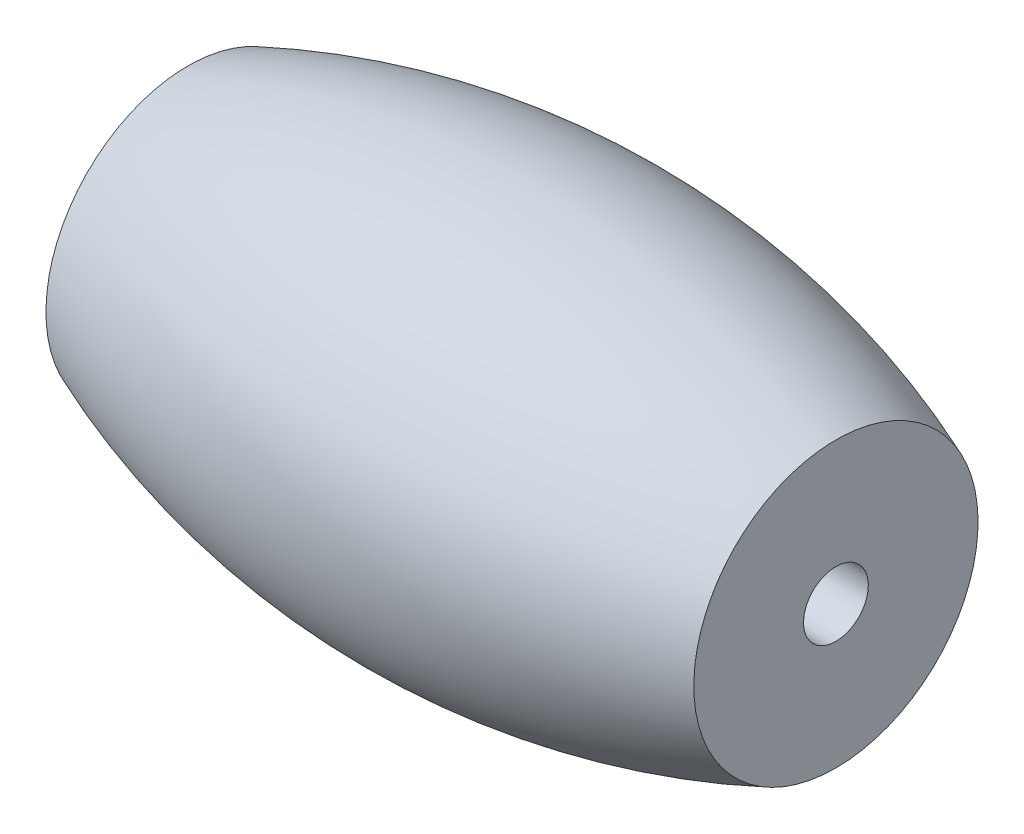
ISO-10303-21;
HEADER;
FILE_DESCRIPTION(('STEP AP214'),'2;1');
FILE_NAME('part.step','',(''),(''),'','','');
FILE_SCHEMA(('AUTOMOTIVE_DESIGN { 1 0 10303 214 1 1 1 1 }'));
ENDSEC;
DATA;
#1=APPLICATION_CONTEXT('core data for automotive mechanical design processes');
#2=APPLICATION_PROTOCOL_DEFINITION('international standard','automotive_design',2000,#1);
#3=PRODUCT_CONTEXT('',#1,'mechanical');
#4=PRODUCT('Part','Part','',(#3));
#5=PRODUCT_RELATED_PRODUCT_CATEGORY('part','',(#4));
#6=PRODUCT_DEFINITION_FORMATION('','',#4);
#7=PRODUCT_DEFINITION_CONTEXT('part definition',#1,'design');
#8=PRODUCT_DEFINITION('design','',#6,#7);
#9=PRODUCT_DEFINITION_SHAPE('','',#8);
#10=(LENGTH_UNIT() NAMED_UNIT(*) SI_UNIT(.MILLI.,.METRE.));
#11=(NAMED_UNIT(*) PLANE_ANGLE_UNIT() SI_UNIT($,.RADIAN.));
#12=(NAMED_UNIT(*) SI_UNIT($,.STERADIAN.) SOLID_ANGLE_UNIT());
#13=UNCERTAINTY_MEASURE_WITH_UNIT(LENGTH_MEASURE(1.E-05),#10,'distance_accuracy_value','');
#14=(GEOMETRIC_REPRESENTATION_CONTEXT(3) GLOBAL_UNCERTAINTY_ASSIGNED_CONTEXT((#13)) GLOBAL_UNIT_ASSIGNED_CONTEXT((#10,
#11,#12)) REPRESENTATION_CONTEXT('',''));
#15=CARTESIAN_POINT('',(0.,0.,0.));
#16=DIRECTION('',(0.,0.,1.));
#17=DIRECTION('',(1.,0.,0.));
#18=AXIS2_PLACEMENT_3D('',#15,#16,#17);
#19=CARTESIAN_POINT('',(15.,30.5,0.));
#20=DIRECTION('',(-1.,0.,0.));
#21=DIRECTION('',(0.,-1.,0.));
#22=AXIS2_PLACEMENT_3D('',#19,#20,#21);
#23=PLANE('',#22);
#24=CARTESIAN_POINT('',(15.,30.5,0.));
#25=DIRECTION('',(-1.,0.,0.));
#26=DIRECTION('',(0.,-1.,0.));
#27=AXIS2_PLACEMENT_3D('',#24,#25,#26);
#28=CIRCLE('',#27,1.5);
#29=CARTESIAN_POINT('',(15.,29.,0.));
#30=VERTEX_POINT('',#29);
#31=EDGE_CURVE('E42',#30,#30,#28,.T.);
#32=ORIENTED_EDGE('',*,*,#31,.T.);
#33=EDGE_LOOP('',(#32));
#34=FACE_BOUND('',#33,.T.);
#35=CARTESIAN_POINT('',(15.,30.5,0.));
#36=DIRECTION('',(-1.,0.,0.));
#37=DIRECTION('',(0.,-1.,0.));
#38=AXIS2_PLACEMENT_3D('',#35,#36,#37);
#39=CIRCLE('',#38,6.58099243547832);
#40=CARTESIAN_POINT('',(15.,23.9190075645217,0.));
#41=VERTEX_POINT('',#40);
#42=EDGE_CURVE('E10',#41,#41,#39,.T.);
#43=ORIENTED_EDGE('',*,*,#42,.F.);
#44=EDGE_LOOP('',(#43));
#45=FACE_BOUND('',#44,.T.);
#46=ADVANCED_FACE('F32',(#34,#45),#23,.F.);
#47=CARTESIAN_POINT('',(0.,30.5,0.));
#48=DIRECTION('',(-1.,0.,0.));
#49=DIRECTION('',(0.,-1.,0.));
#50=AXIS2_PLACEMENT_3D('',#47,#48,#49);
#51=DEGENERATE_TOROIDAL_SURFACE('',#50,30.5,40.,.F.);
#52=CARTESIAN_POINT('',(-15.,30.5,0.));
#53=DIRECTION('',(-1.,0.,0.));
#54=DIRECTION('',(0.,-1.,0.));
#55=AXIS2_PLACEMENT_3D('',#52,#53,#54);
#56=CIRCLE('',#55,6.58099243547832);
#57=CARTESIAN_POINT('',(-15.,23.9190075645217,0.));
#58=VERTEX_POINT('',#57);
#59=EDGE_CURVE('E38',#58,#58,#56,.T.);
#60=ORIENTED_EDGE('',*,*,#59,.F.);
#61=EDGE_LOOP('',(#60));
#62=FACE_BOUND('',#61,.T.);
#63=ORIENTED_EDGE('',*,*,#42,.T.);
#64=EDGE_LOOP('',(#63));
#65=FACE_BOUND('',#64,.T.);
#66=ADVANCED_FACE('F56',(#62,#65),#51,.F.);
#67=CARTESIAN_POINT('',(-15.,30.5,0.));
#68=DIRECTION('',(1.,0.,0.));
#69=DIRECTION('',(0.,1.,0.));
#70=AXIS2_PLACEMENT_3D('',#67,#68,#69);
#71=PLANE('',#70);
#72=CARTESIAN_POINT('',(-15.,30.5,0.));
#73=DIRECTION('',(-1.,0.,0.));
#74=DIRECTION('',(0.,-1.,0.));
#75=AXIS2_PLACEMENT_3D('',#72,#73,#74);
#76=CIRCLE('',#75,1.5);
#77=CARTESIAN_POINT('',(-15.,29.,0.));
#78=VERTEX_POINT('',#77);
#79=EDGE_CURVE('E46',#78,#78,#76,.T.);
#80=ORIENTED_EDGE('',*,*,#79,.F.);
#81=EDGE_LOOP('',(#80));
#82=FACE_BOUND('',#81,.T.);
#83=ORIENTED_EDGE('',*,*,#59,.T.);
#84=EDGE_LOOP('',(#83));
#85=FACE_BOUND('',#84,.T.);
#86=ADVANCED_FACE('F54',(#82,#85),#71,.F.);
#87=CARTESIAN_POINT('',(15.,30.5,0.));
#88=DIRECTION('',(-1.,0.,0.));
#89=DIRECTION('',(0.,-1.,0.));
#90=AXIS2_PLACEMENT_3D('',#87,#88,#89);
#91=CYLINDRICAL_SURFACE('',#90,1.5);
#92=ORIENTED_EDGE('',*,*,#31,.F.);
#93=EDGE_LOOP('',(#92));
#94=FACE_BOUND('',#93,.T.);
#95=ORIENTED_EDGE('',*,*,#79,.T.);
#96=EDGE_LOOP('',(#95));
#97=FACE_BOUND('',#96,.T.);
#98=ADVANCED_FACE('F52',(#94,#97),#91,.F.);
#99=CLOSED_SHELL('',(#46,#66,#86,#98));
#100=MANIFOLD_SOLID_BREP('B2',#99);
#101=ADVANCED_BREP_SHAPE_REPRESENTATION('',(#18,#100),#14);
#102=SHAPE_DEFINITION_REPRESENTATION(#9,#101);
ENDSEC;
END-ISO-10303-21;
